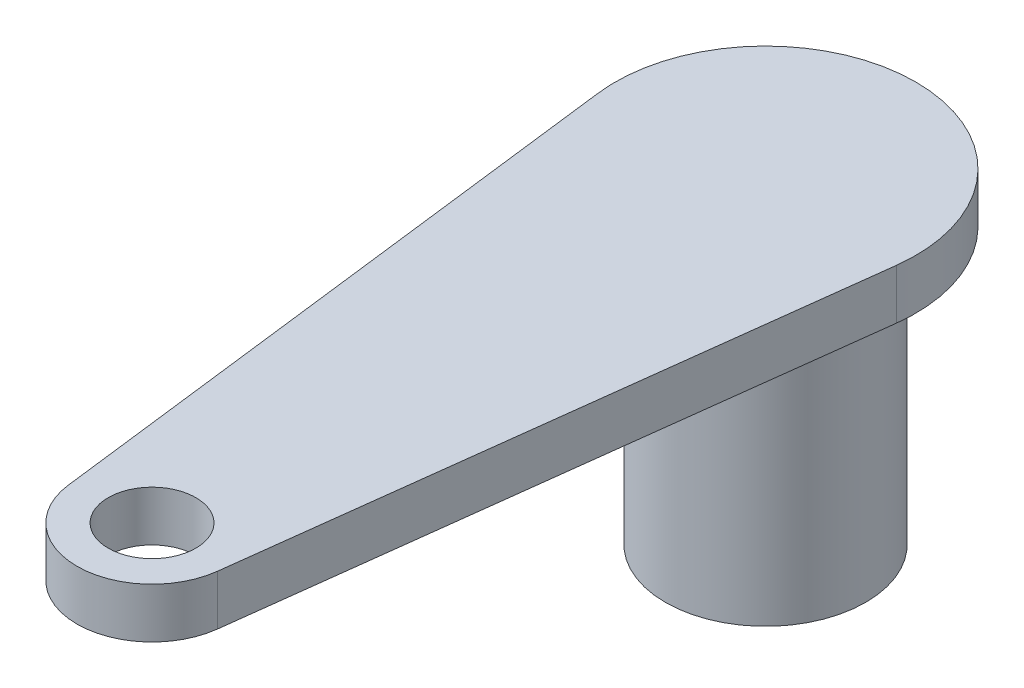
ISO-10303-21;
HEADER;
FILE_DESCRIPTION(('STEP AP214'),'2;1');
FILE_NAME('part.step','',(''),(''),'','','');
FILE_SCHEMA(('AUTOMOTIVE_DESIGN { 1 0 10303 214 1 1 1 1 }'));
ENDSEC;
DATA;
#1=APPLICATION_CONTEXT('core data for automotive mechanical design processes');
#2=APPLICATION_PROTOCOL_DEFINITION('international standard','automotive_design',2000,#1);
#3=PRODUCT_CONTEXT('',#1,'mechanical');
#4=PRODUCT('Part','Part','',(#3));
#5=PRODUCT_RELATED_PRODUCT_CATEGORY('part','',(#4));
#6=PRODUCT_DEFINITION_FORMATION('','',#4);
#7=PRODUCT_DEFINITION_CONTEXT('part definition',#1,'design');
#8=PRODUCT_DEFINITION('design','',#6,#7);
#9=PRODUCT_DEFINITION_SHAPE('','',#8);
#10=(LENGTH_UNIT() NAMED_UNIT(*) SI_UNIT(.MILLI.,.METRE.));
#11=(NAMED_UNIT(*) PLANE_ANGLE_UNIT() SI_UNIT($,.RADIAN.));
#12=(NAMED_UNIT(*) SI_UNIT($,.STERADIAN.) SOLID_ANGLE_UNIT());
#13=UNCERTAINTY_MEASURE_WITH_UNIT(LENGTH_MEASURE(1.E-05),#10,'distance_accuracy_value','');
#14=(GEOMETRIC_REPRESENTATION_CONTEXT(3) GLOBAL_UNCERTAINTY_ASSIGNED_CONTEXT((#13)) GLOBAL_UNIT_ASSIGNED_CONTEXT((#10,
#11,#12)) REPRESENTATION_CONTEXT('',''));
#15=CARTESIAN_POINT('',(0.,0.,0.));
#16=DIRECTION('',(0.,0.,1.));
#17=DIRECTION('',(1.,0.,0.));
#18=AXIS2_PLACEMENT_3D('',#15,#16,#17);
#19=CARTESIAN_POINT('',(0.,13.,0.));
#20=DIRECTION('',(0.,1.,0.));
#21=DIRECTION('',(0.,0.,1.));
#22=AXIS2_PLACEMENT_3D('',#19,#20,#21);
#23=PLANE('',#22);
#24=CARTESIAN_POINT('',(0.,13.,24.5));
#25=DIRECTION('',(0.,1.,0.));
#26=DIRECTION('',(0.,0.,1.));
#27=AXIS2_PLACEMENT_3D('',#24,#25,#26);
#28=CIRCLE('',#27,1.75);
#29=CARTESIAN_POINT('',(0.,13.,26.25));
#30=VERTEX_POINT('',#29);
#31=EDGE_CURVE('E128',#30,#30,#28,.T.);
#32=ORIENTED_EDGE('',*,*,#31,.F.);
#33=EDGE_LOOP('',(#32));
#34=FACE_BOUND('',#33,.T.);
#35=DIRECTION('',(-0.122448979591837,0.,-0.992474809452068));
#36=VECTOR('',#35,1.);
#37=CARTESIAN_POINT('',(-5.95484885671241,13.,0.734693877551021));
#38=LINE('',#37,#36);
#39=CARTESIAN_POINT('',(-2.9774244283562,13.,24.8673469387755));
#40=VERTEX_POINT('',#39);
#41=CARTESIAN_POINT('',(-5.95484885671241,13.,0.734693877551021));
#42=VERTEX_POINT('',#41);
#43=EDGE_CURVE('E107',#40,#42,#38,.T.);
#44=ORIENTED_EDGE('',*,*,#43,.F.);
#45=CARTESIAN_POINT('',(0.,13.,24.5));
#46=DIRECTION('',(0.,1.,0.));
#47=DIRECTION('',(0.,0.,1.));
#48=AXIS2_PLACEMENT_3D('',#45,#46,#47);
#49=CIRCLE('',#48,3.);
#50=CARTESIAN_POINT('',(2.97742442835621,13.,24.8673469387755));
#51=VERTEX_POINT('',#50);
#52=EDGE_CURVE('E68',#40,#51,#49,.T.);
#53=ORIENTED_EDGE('',*,*,#52,.T.);
#54=DIRECTION('',(0.122448979591837,0.,-0.992474809452068));
#55=VECTOR('',#54,1.);
#56=CARTESIAN_POINT('',(5.95484885671241,13.,0.73469387755102));
#57=LINE('',#56,#55);
#58=CARTESIAN_POINT('',(5.95484885671241,13.,0.73469387755102));
#59=VERTEX_POINT('',#58);
#60=EDGE_CURVE('E113',#51,#59,#57,.T.);
#61=ORIENTED_EDGE('',*,*,#60,.T.);
#62=CARTESIAN_POINT('',(0.,13.,0.));
#63=DIRECTION('',(0.,1.,0.));
#64=DIRECTION('',(0.,0.,1.));
#65=AXIS2_PLACEMENT_3D('',#62,#63,#64);
#66=CIRCLE('',#65,6.);
#67=EDGE_CURVE('E97',#59,#42,#66,.T.);
#68=ORIENTED_EDGE('',*,*,#67,.T.);
#69=EDGE_LOOP('',(#44,#53,#61,#68));
#70=FACE_BOUND('',#69,.T.);
#71=ADVANCED_FACE('F52',(#34,#70),#23,.T.);
#72=CARTESIAN_POINT('',(0.,11.,0.));
#73=DIRECTION('',(0.,1.,0.));
#74=DIRECTION('',(0.,0.,1.));
#75=AXIS2_PLACEMENT_3D('',#72,#73,#74);
#76=PLANE('',#75);
#77=CARTESIAN_POINT('',(0.,11.,24.5));
#78=DIRECTION('',(0.,1.,0.));
#79=DIRECTION('',(0.,0.,1.));
#80=AXIS2_PLACEMENT_3D('',#77,#78,#79);
#81=CIRCLE('',#80,1.75);
#82=CARTESIAN_POINT('',(0.,11.,26.25));
#83=VERTEX_POINT('',#82);
#84=EDGE_CURVE('E123',#83,#83,#81,.T.);
#85=ORIENTED_EDGE('',*,*,#84,.T.);
#86=EDGE_LOOP('',(#85));
#87=FACE_BOUND('',#86,.T.);
#88=CARTESIAN_POINT('',(0.,11.,24.5));
#89=DIRECTION('',(0.,1.,0.));
#90=DIRECTION('',(0.,0.,1.));
#91=AXIS2_PLACEMENT_3D('',#88,#89,#90);
#92=CIRCLE('',#91,3.);
#93=CARTESIAN_POINT('',(-2.9774244283562,11.,24.8673469387755));
#94=VERTEX_POINT('',#93);
#95=CARTESIAN_POINT('',(2.97742442835621,11.,24.8673469387755));
#96=VERTEX_POINT('',#95);
#97=EDGE_CURVE('E12',#94,#96,#92,.T.);
#98=ORIENTED_EDGE('',*,*,#97,.F.);
#99=DIRECTION('',(-0.122448979591837,0.,-0.992474809452068));
#100=VECTOR('',#99,1.);
#101=CARTESIAN_POINT('',(-5.95484885671241,11.,0.734693877551022));
#102=LINE('',#101,#100);
#103=CARTESIAN_POINT('',(-5.95484885671241,11.,0.734693877551021));
#104=VERTEX_POINT('',#103);
#105=EDGE_CURVE('E132',#94,#104,#102,.T.);
#106=ORIENTED_EDGE('',*,*,#105,.T.);
#107=CARTESIAN_POINT('',(0.,11.,0.));
#108=DIRECTION('',(0.,1.,0.));
#109=DIRECTION('',(0.,0.,1.));
#110=AXIS2_PLACEMENT_3D('',#107,#108,#109);
#111=CIRCLE('',#110,6.);
#112=CARTESIAN_POINT('',(5.95484885671241,11.,0.73469387755102));
#113=VERTEX_POINT('',#112);
#114=EDGE_CURVE('E100',#113,#104,#111,.T.);
#115=ORIENTED_EDGE('',*,*,#114,.F.);
#116=DIRECTION('',(0.122448979591837,0.,-0.992474809452068));
#117=VECTOR('',#116,1.);
#118=CARTESIAN_POINT('',(5.95484885671241,11.,0.73469387755102));
#119=LINE('',#118,#117);
#120=EDGE_CURVE('E61',#96,#113,#119,.T.);
#121=ORIENTED_EDGE('',*,*,#120,.F.);
#122=EDGE_LOOP('',(#98,#106,#115,#121));
#123=FACE_BOUND('',#122,.T.);
#124=ADVANCED_FACE('F145',(#87,#123),#76,.F.);
#125=CARTESIAN_POINT('',(0.,13.,24.5));
#126=DIRECTION('',(0.,-1.,0.));
#127=DIRECTION('',(0.,0.,-1.));
#128=AXIS2_PLACEMENT_3D('',#125,#126,#127);
#129=CYLINDRICAL_SURFACE('',#128,1.75);
#130=ORIENTED_EDGE('',*,*,#31,.T.);
#131=EDGE_LOOP('',(#130));
#132=FACE_BOUND('',#131,.T.);
#133=ORIENTED_EDGE('',*,*,#84,.F.);
#134=EDGE_LOOP('',(#133));
#135=FACE_BOUND('',#134,.T.);
#136=ADVANCED_FACE('F54',(#132,#135),#129,.F.);
#137=CARTESIAN_POINT('',(0.,0.,24.5));
#138=DIRECTION('',(0.,1.,0.));
#139=DIRECTION('',(0.,0.,1.));
#140=AXIS2_PLACEMENT_3D('',#137,#138,#139);
#141=CYLINDRICAL_SURFACE('',#140,3.);
#142=DIRECTION('',(0.,1.,0.));
#143=VECTOR('',#142,1.);
#144=CARTESIAN_POINT('',(-2.9774244283562,0.,24.8673469387755));
#145=LINE('',#144,#143);
#146=EDGE_CURVE('E104',#94,#40,#145,.T.);
#147=ORIENTED_EDGE('',*,*,#146,.F.);
#148=ORIENTED_EDGE('',*,*,#97,.T.);
#149=DIRECTION('',(0.,1.,0.));
#150=VECTOR('',#149,1.);
#151=CARTESIAN_POINT('',(2.97742442835621,0.,24.8673469387755));
#152=LINE('',#151,#150);
#153=EDGE_CURVE('E120',#96,#51,#152,.T.);
#154=ORIENTED_EDGE('',*,*,#153,.T.);
#155=ORIENTED_EDGE('',*,*,#52,.F.);
#156=EDGE_LOOP('',(#147,#148,#154,#155));
#157=FACE_BOUND('',#156,.T.);
#158=ADVANCED_FACE('F146',(#157),#141,.T.);
#159=CARTESIAN_POINT('',(5.95484885671241,0.,0.73469387755102));
#160=DIRECTION('',(0.992474809452068,0.,0.122448979591837));
#161=DIRECTION('',(0.122448979591837,0.,-0.992474809452068));
#162=AXIS2_PLACEMENT_3D('',#159,#160,#161);
#163=PLANE('',#162);
#164=ORIENTED_EDGE('',*,*,#120,.T.);
#165=DIRECTION('',(0.,1.,0.));
#166=VECTOR('',#165,1.);
#167=CARTESIAN_POINT('',(5.95484885671241,0.,0.73469387755102));
#168=LINE('',#167,#166);
#169=EDGE_CURVE('E103',#113,#59,#168,.T.);
#170=ORIENTED_EDGE('',*,*,#169,.T.);
#171=ORIENTED_EDGE('',*,*,#60,.F.);
#172=ORIENTED_EDGE('',*,*,#153,.F.);
#173=EDGE_LOOP('',(#164,#170,#171,#172));
#174=FACE_BOUND('',#173,.T.);
#175=ADVANCED_FACE('F143',(#174),#163,.T.);
#176=CARTESIAN_POINT('',(0.,0.,0.));
#177=DIRECTION('',(0.,1.,0.));
#178=DIRECTION('',(0.,0.,1.));
#179=AXIS2_PLACEMENT_3D('',#176,#177,#178);
#180=CYLINDRICAL_SURFACE('',#179,6.);
#181=ORIENTED_EDGE('',*,*,#114,.T.);
#182=DIRECTION('',(0.,1.,0.));
#183=VECTOR('',#182,1.);
#184=CARTESIAN_POINT('',(-5.95484885671241,0.,0.734693877551021));
#185=LINE('',#184,#183);
#186=EDGE_CURVE('E76',#104,#42,#185,.T.);
#187=ORIENTED_EDGE('',*,*,#186,.T.);
#188=ORIENTED_EDGE('',*,*,#67,.F.);
#189=ORIENTED_EDGE('',*,*,#169,.F.);
#190=EDGE_LOOP('',(#181,#187,#188,#189));
#191=FACE_BOUND('',#190,.T.);
#192=ADVANCED_FACE('F94',(#191),#180,.T.);
#193=CARTESIAN_POINT('',(-5.95484885671241,0.,0.734693877551021));
#194=DIRECTION('',(0.992474809452068,0.,-0.122448979591837));
#195=DIRECTION('',(-0.122448979591837,0.,-0.992474809452068));
#196=AXIS2_PLACEMENT_3D('',#193,#194,#195);
#197=PLANE('',#196);
#198=ORIENTED_EDGE('',*,*,#146,.T.);
#199=ORIENTED_EDGE('',*,*,#43,.T.);
#200=ORIENTED_EDGE('',*,*,#186,.F.);
#201=ORIENTED_EDGE('',*,*,#105,.F.);
#202=EDGE_LOOP('',(#198,#199,#200,#201));
#203=FACE_BOUND('',#202,.T.);
#204=ADVANCED_FACE('F108',(#203),#197,.F.);
#205=CLOSED_SHELL('',(#71,#124,#136,#158,#175,#192,#204));
#206=MANIFOLD_SOLID_BREP('B2',#205);
#207=CARTESIAN_POINT('',(0.,11.,0.));
#208=DIRECTION('',(0.,1.,0.));
#209=DIRECTION('',(0.,0.,1.));
#210=AXIS2_PLACEMENT_3D('',#207,#208,#209);
#211=PLANE('',#210);
#212=CARTESIAN_POINT('',(0.,11.,0.));
#213=DIRECTION('',(0.,1.,0.));
#214=DIRECTION('',(0.,0.,1.));
#215=AXIS2_PLACEMENT_3D('',#212,#213,#214);
#216=CIRCLE('',#215,4.);
#217=CARTESIAN_POINT('',(0.,11.,4.));
#218=VERTEX_POINT('',#217);
#219=EDGE_CURVE('E51',#218,#218,#216,.T.);
#220=ORIENTED_EDGE('',*,*,#219,.T.);
#221=EDGE_LOOP('',(#220));
#222=FACE_BOUND('',#221,.T.);
#223=CARTESIAN_POINT('',(0.,11.,0.));
#224=DIRECTION('',(0.,1.,0.));
#225=DIRECTION('',(0.,0.,1.));
#226=AXIS2_PLACEMENT_3D('',#223,#224,#225);
#227=CIRCLE('',#226,3.);
#228=CARTESIAN_POINT('',(0.,11.,3.));
#229=VERTEX_POINT('',#228);
#230=EDGE_CURVE('E241',#229,#229,#227,.T.);
#231=ORIENTED_EDGE('',*,*,#230,.F.);
#232=EDGE_LOOP('',(#231));
#233=FACE_BOUND('',#232,.T.);
#234=ADVANCED_FACE('F230',(#222,#233),#211,.T.);
#235=CARTESIAN_POINT('',(0.,0.,0.));
#236=DIRECTION('',(0.,1.,0.));
#237=DIRECTION('',(0.,0.,1.));
#238=AXIS2_PLACEMENT_3D('',#235,#236,#237);
#239=PLANE('',#238);
#240=CARTESIAN_POINT('',(0.,0.,0.));
#241=DIRECTION('',(0.,1.,0.));
#242=DIRECTION('',(0.,0.,1.));
#243=AXIS2_PLACEMENT_3D('',#240,#241,#242);
#244=CIRCLE('',#243,4.);
#245=CARTESIAN_POINT('',(0.,0.,4.));
#246=VERTEX_POINT('',#245);
#247=EDGE_CURVE('E234',#246,#246,#244,.T.);
#248=ORIENTED_EDGE('',*,*,#247,.F.);
#249=EDGE_LOOP('',(#248));
#250=FACE_BOUND('',#249,.T.);
#251=CARTESIAN_POINT('',(0.,0.,0.));
#252=DIRECTION('',(0.,1.,0.));
#253=DIRECTION('',(0.,0.,1.));
#254=AXIS2_PLACEMENT_3D('',#251,#252,#253);
#255=CIRCLE('',#254,3.);
#256=CARTESIAN_POINT('',(0.,0.,3.));
#257=VERTEX_POINT('',#256);
#258=EDGE_CURVE('E243',#257,#257,#255,.T.);
#259=ORIENTED_EDGE('',*,*,#258,.T.);
#260=EDGE_LOOP('',(#259));
#261=FACE_BOUND('',#260,.T.);
#262=ADVANCED_FACE('F253',(#250,#261),#239,.F.);
#263=CARTESIAN_POINT('',(0.,11.,0.));
#264=DIRECTION('',(0.,-1.,0.));
#265=DIRECTION('',(0.,0.,-1.));
#266=AXIS2_PLACEMENT_3D('',#263,#264,#265);
#267=CYLINDRICAL_SURFACE('',#266,4.);
#268=ORIENTED_EDGE('',*,*,#219,.F.);
#269=EDGE_LOOP('',(#268));
#270=FACE_BOUND('',#269,.T.);
#271=ORIENTED_EDGE('',*,*,#247,.T.);
#272=EDGE_LOOP('',(#271));
#273=FACE_BOUND('',#272,.T.);
#274=ADVANCED_FACE('F232',(#270,#273),#267,.T.);
#275=CARTESIAN_POINT('',(0.,11.,0.));
#276=DIRECTION('',(0.,-1.,0.));
#277=DIRECTION('',(0.,0.,-1.));
#278=AXIS2_PLACEMENT_3D('',#275,#276,#277);
#279=CYLINDRICAL_SURFACE('',#278,3.);
#280=ORIENTED_EDGE('',*,*,#230,.T.);
#281=EDGE_LOOP('',(#280));
#282=FACE_BOUND('',#281,.T.);
#283=ORIENTED_EDGE('',*,*,#258,.F.);
#284=EDGE_LOOP('',(#283));
#285=FACE_BOUND('',#284,.T.);
#286=ADVANCED_FACE('F249',(#282,#285),#279,.F.);
#287=CLOSED_SHELL('',(#234,#262,#274,#286));
#288=MANIFOLD_SOLID_BREP('B6',#287);
#289=ADVANCED_BREP_SHAPE_REPRESENTATION('',(#18,#206,#288),#14);
#290=SHAPE_DEFINITION_REPRESENTATION(#9,#289);
ENDSEC;
END-ISO-10303-21;
